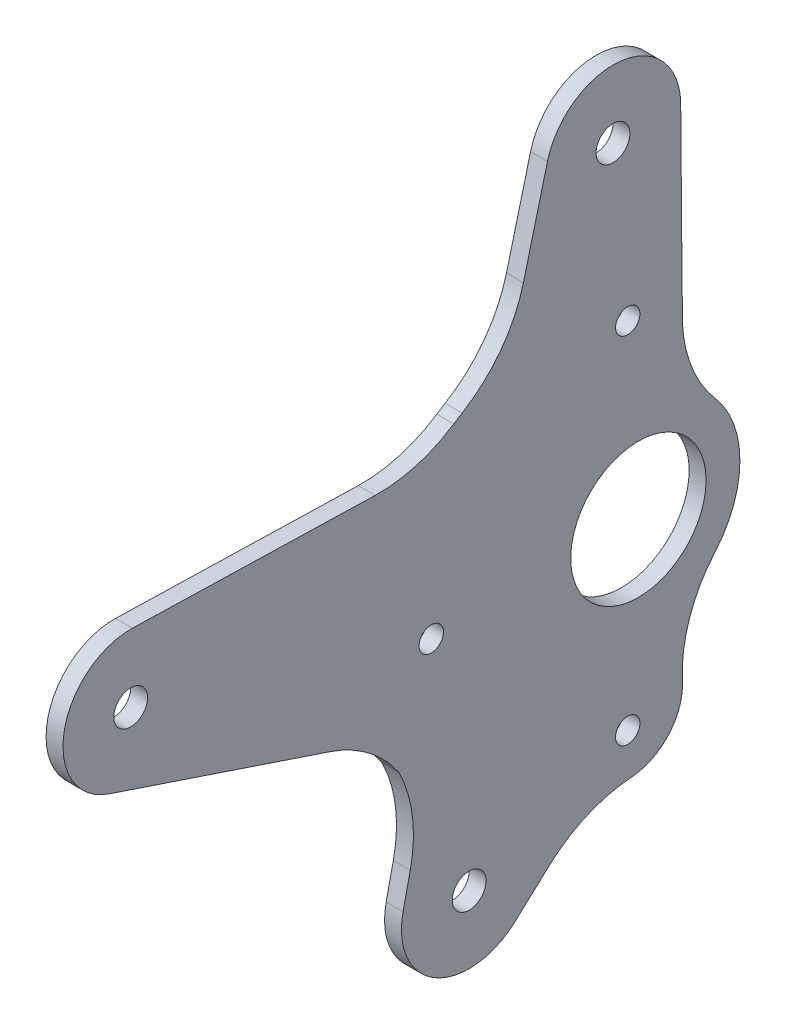
ISO-10303-21;
HEADER;
FILE_DESCRIPTION(('STEP AP214'),'2;1');
FILE_NAME('part.step','',(''),(''),'','','');
FILE_SCHEMA(('AUTOMOTIVE_DESIGN { 1 0 10303 214 1 1 1 1 }'));
ENDSEC;
DATA;
#1=APPLICATION_CONTEXT('core data for automotive mechanical design processes');
#2=APPLICATION_PROTOCOL_DEFINITION('international standard','automotive_design',2000,#1);
#3=PRODUCT_CONTEXT('',#1,'mechanical');
#4=PRODUCT('Part','Part','',(#3));
#5=PRODUCT_RELATED_PRODUCT_CATEGORY('part','',(#4));
#6=PRODUCT_DEFINITION_FORMATION('','',#4);
#7=PRODUCT_DEFINITION_CONTEXT('part definition',#1,'design');
#8=PRODUCT_DEFINITION('design','',#6,#7);
#9=PRODUCT_DEFINITION_SHAPE('','',#8);
#10=(LENGTH_UNIT() NAMED_UNIT(*) SI_UNIT(.MILLI.,.METRE.));
#11=(NAMED_UNIT(*) PLANE_ANGLE_UNIT() SI_UNIT($,.RADIAN.));
#12=(NAMED_UNIT(*) SI_UNIT($,.STERADIAN.) SOLID_ANGLE_UNIT());
#13=UNCERTAINTY_MEASURE_WITH_UNIT(LENGTH_MEASURE(1.E-05),#10,'distance_accuracy_value','');
#14=(GEOMETRIC_REPRESENTATION_CONTEXT(3) GLOBAL_UNCERTAINTY_ASSIGNED_CONTEXT((#13)) GLOBAL_UNIT_ASSIGNED_CONTEXT((#10,
#11,#12)) REPRESENTATION_CONTEXT('',''));
#15=CARTESIAN_POINT('',(0.,0.,0.));
#16=DIRECTION('',(0.,0.,1.));
#17=DIRECTION('',(1.,0.,0.));
#18=AXIS2_PLACEMENT_3D('',#15,#16,#17);
#19=CARTESIAN_POINT('',(-3.175,0.,0.));
#20=DIRECTION('',(1.,0.,0.));
#21=DIRECTION('',(0.,0.,-1.));
#22=AXIS2_PLACEMENT_3D('',#19,#20,#21);
#23=PLANE('',#22);
#24=CARTESIAN_POINT('',(-3.175,41.275,2.00000000000017));
#25=CARTESIAN_POINT('',(-3.175,41.275,72.6458636832659));
#26=CARTESIAN_POINT('',(-3.175,-41.275,61.4874696500673));
#27=CARTESIAN_POINT('',(-3.175,-41.275,2.00000000000017));
#28=B_SPLINE_CURVE_WITH_KNOTS('',3,(#24,#25,#26,#27),.UNSPECIFIED.,.F.,.F.,(4,4),(0.,1.),.UNSPECIFIED.);
#29=CARTESIAN_POINT('',(-3.175,33.8133672718998,33.0730524976087));
#30=VERTEX_POINT('',#29);
#31=CARTESIAN_POINT('',(-3.175,32.8160115880508,34.6500756912321));
#32=VERTEX_POINT('',#31);
#33=EDGE_CURVE('E489',#30,#32,#28,.T.);
#34=ORIENTED_EDGE('',*,*,#33,.F.);
#35=CARTESIAN_POINT('',(-3.175,55.5798412709307,46.1642942129508));
#36=DIRECTION('',(1.,0.,0.));
#37=DIRECTION('',(0.,0.,-1.));
#38=AXIS2_PLACEMENT_3D('',#35,#36,#37);
#39=CIRCLE('',#38,25.4);
#40=CARTESIAN_POINT('',(-3.175,49.2201891679587,21.5733441473441));
#41=VERTEX_POINT('',#40);
#42=EDGE_CURVE('E12',#30,#41,#39,.T.);
#43=ORIENTED_EDGE('',*,*,#42,.T.);
#44=DIRECTION('',(0.,-0.968147640378217,0.250380004054017));
#45=VECTOR('',#44,1.);
#46=CARTESIAN_POINT('',(-3.175,66.6798260514913,17.057975032802));
#47=LINE('',#46,#45);
#48=CARTESIAN_POINT('',(-3.175,66.6798260514913,17.057975032802));
#49=VERTEX_POINT('',#48);
#50=EDGE_CURVE('E410',#49,#41,#47,.T.);
#51=ORIENTED_EDGE('',*,*,#50,.F.);
#52=CARTESIAN_POINT('',(-3.175,63.5,4.76250000000001));
#53=DIRECTION('',(1.,0.,0.));
#54=DIRECTION('',(0.,0.,1.));
#55=AXIS2_PLACEMENT_3D('',#52,#53,#54);
#56=CIRCLE('',#55,12.7);
#57=CARTESIAN_POINT('',(-3.175,63.6108270008294,-7.93701642291497));
#58=VERTEX_POINT('',#57);
#59=EDGE_CURVE('E407',#58,#49,#56,.T.);
#60=ORIENTED_EDGE('',*,*,#59,.F.);
#61=DIRECTION('',(0.,0.999961923064171,0.00872653549838098));
#62=VECTOR('',#61,1.);
#63=CARTESIAN_POINT('',(-3.175,63.6108270008294,-7.93701642291497));
#64=LINE('',#63,#62);
#65=CARTESIAN_POINT('',(-3.175,33.047304679726,-8.20374024143136));
#66=VERTEX_POINT('',#65);
#67=EDGE_CURVE('E414',#66,#58,#64,.T.);
#68=ORIENTED_EDGE('',*,*,#67,.F.);
#69=CARTESIAN_POINT('',(-3.175,33.2689586813848,-33.6027730872613));
#70=DIRECTION('',(1.,0.,0.));
#71=DIRECTION('',(0.,0.,-1.));
#72=AXIS2_PLACEMENT_3D('',#69,#70,#71);
#73=CIRCLE('',#72,25.4);
#74=CARTESIAN_POINT('',(-3.175,31.6534982607126,-8.25419743439194));
#75=VERTEX_POINT('',#74);
#76=EDGE_CURVE('E590',#66,#75,#73,.T.);
#77=ORIENTED_EDGE('',*,*,#76,.T.);
#78=CARTESIAN_POINT('',(-3.175,30.9999999999871,2.00000000000016));
#79=DIRECTION('',(1.,0.,0.));
#80=DIRECTION('',(0.,0.,-1.));
#81=AXIS2_PLACEMENT_3D('',#78,#79,#80);
#82=CIRCLE('',#81,10.2750000000129);
#83=CARTESIAN_POINT('',(-3.175,30.4452831683227,-8.2600153136791));
#84=VERTEX_POINT('',#83);
#85=EDGE_CURVE('E451',#75,#84,#82,.F.);
#86=ORIENTED_EDGE('',*,*,#85,.T.);
#87=CARTESIAN_POINT('',(-3.175,29.074012363042,-33.6229728773897));
#88=DIRECTION('',(1.,0.,0.));
#89=DIRECTION('',(0.,0.,-1.));
#90=AXIS2_PLACEMENT_3D('',#87,#88,#89);
#91=CIRCLE('',#90,25.4);
#92=CARTESIAN_POINT('',(-3.175,12.4602910127323,-14.4098455188813));
#93=VERTEX_POINT('',#92);
#94=EDGE_CURVE('E457',#84,#93,#91,.T.);
#95=ORIENTED_EDGE('',*,*,#94,.T.);
#96=CARTESIAN_POINT('',(-3.175,0.,0.));
#97=DIRECTION('',(1.,0.,0.));
#98=DIRECTION('',(0.,0.,-1.));
#99=AXIS2_PLACEMENT_3D('',#96,#97,#98);
#100=CIRCLE('',#99,19.05);
#101=CARTESIAN_POINT('',(-3.175,-12.4602910127323,-14.4098455188813));
#102=VERTEX_POINT('',#101);
#103=EDGE_CURVE('E461',#93,#102,#100,.F.);
#104=ORIENTED_EDGE('',*,*,#103,.T.);
#105=CARTESIAN_POINT('',(-3.175,-29.074012363042,-33.6229728773897));
#106=DIRECTION('',(1.,0.,0.));
#107=DIRECTION('',(0.,0.,-1.));
#108=AXIS2_PLACEMENT_3D('',#105,#106,#107);
#109=CIRCLE('',#108,25.4);
#110=CARTESIAN_POINT('',(-3.175,-30.4452831683234,-8.26001531366554));
#111=VERTEX_POINT('',#110);
#112=EDGE_CURVE('E479',#111,#102,#109,.F.);
#113=ORIENTED_EDGE('',*,*,#112,.F.);
#114=CARTESIAN_POINT('',(-3.175,-31.0000000000129,2.00000000000017));
#115=DIRECTION('',(1.,0.,0.));
#116=DIRECTION('',(0.,0.,-1.));
#117=AXIS2_PLACEMENT_3D('',#114,#115,#116);
#118=CIRCLE('',#117,10.2750000000007);
#119=CARTESIAN_POINT('',(-3.175,-41.2500342971273,1.28416349073758));
#120=VERTEX_POINT('',#119);
#121=EDGE_CURVE('E481',#120,#111,#118,.T.);
#122=ORIENTED_EDGE('',*,*,#121,.F.);
#123=CARTESIAN_POINT('',(-3.175,-66.5883185936419,-0.485398293716785));
#124=DIRECTION('',(1.,0.,0.));
#125=DIRECTION('',(0.,0.,-1.));
#126=AXIS2_PLACEMENT_3D('',#123,#124,#125);
#127=CIRCLE('',#126,25.4);
#128=CARTESIAN_POINT('',(-3.175,-47.8614742386648,16.6745929797211));
#129=VERTEX_POINT('',#128);
#130=EDGE_CURVE('E578',#120,#129,#127,.T.);
#131=ORIENTED_EDGE('',*,*,#130,.T.);
#132=DIRECTION('',(0.,0.675590207615664,-0.73727733681012));
#133=VECTOR('',#132,1.);
#134=CARTESIAN_POINT('',(-3.175,-40.8727840179756,9.0477759305434));
#135=LINE('',#134,#133);
#136=CARTESIAN_POINT('',(-3.175,-53.8134221774885,23.1700043632811));
#137=VERTEX_POINT('',#136);
#138=EDGE_CURVE('E384',#137,#129,#135,.T.);
#139=ORIENTED_EDGE('',*,*,#138,.F.);
#140=CARTESIAN_POINT('',(-3.175,-44.45,31.75));
#141=DIRECTION('',(1.,0.,0.));
#142=DIRECTION('',(0.,0.,-1.));
#143=AXIS2_PLACEMENT_3D('',#140,#141,#142);
#144=CIRCLE('',#143,12.7);
#145=CARTESIAN_POINT('',(-3.175,-41.7012169029861,44.1489592904232));
#146=VERTEX_POINT('',#145);
#147=EDGE_CURVE('E374',#146,#137,#144,.T.);
#148=ORIENTED_EDGE('',*,*,#147,.F.);
#149=DIRECTION('',(0.,-0.976296007119933,0.216439613938104));
#150=VECTOR('',#149,1.);
#151=CARTESIAN_POINT('',(-3.175,-41.7012169029861,44.1489592904232));
#152=LINE('',#151,#150);
#153=CARTESIAN_POINT('',(-3.175,-35.6223929336524,42.8013164612759));
#154=VERTEX_POINT('',#153);
#155=EDGE_CURVE('E365',#154,#146,#152,.T.);
#156=ORIENTED_EDGE('',*,*,#155,.F.);
#157=CARTESIAN_POINT('',(-3.175,-30.1248267396245,67.5992350421222));
#158=DIRECTION('',(1.,0.,0.));
#159=DIRECTION('',(0.,0.,-1.));
#160=AXIS2_PLACEMENT_3D('',#157,#158,#159);
#161=CIRCLE('',#160,25.4);
#162=CARTESIAN_POINT('',(-3.175,-18.5802542848079,44.9744069359135));
#163=VERTEX_POINT('',#162);
#164=EDGE_CURVE('E238',#154,#163,#161,.T.);
#165=ORIENTED_EDGE('',*,*,#164,.T.);
#166=CARTESIAN_POINT('',(-3.175,-32.9048834464562,65.9497495882102));
#167=DIRECTION('',(1.,0.,0.));
#168=DIRECTION('',(0.,0.,-1.));
#169=AXIS2_PLACEMENT_3D('',#166,#167,#168);
#170=CIRCLE('',#169,25.4);
#171=CARTESIAN_POINT('',(-3.175,-8.81746260421729,57.8902113155251));
#172=VERTEX_POINT('',#171);
#173=EDGE_CURVE('E587',#163,#172,#170,.T.);
#174=ORIENTED_EDGE('',*,*,#173,.T.);
#175=DIRECTION('',(0.,-0.317304656404925,-0.948323655206255));
#176=VECTOR('',#175,1.);
#177=CARTESIAN_POINT('',(-3.175,5.03128971888127,99.2797691363447));
#178=LINE('',#177,#176);
#179=CARTESIAN_POINT('',(-3.175,5.03128971888127,99.2797691363447));
#180=VERTEX_POINT('',#179);
#181=EDGE_CURVE('E440',#180,#172,#178,.T.);
#182=ORIENTED_EDGE('',*,*,#181,.F.);
#183=CARTESIAN_POINT('',(-3.175,17.07500014,95.25));
#184=DIRECTION('',(1.,0.,0.));
#185=DIRECTION('',(0.,0.,-1.));
#186=AXIS2_PLACEMENT_3D('',#183,#184,#185);
#187=CIRCLE('',#186,12.7);
#188=CARTESIAN_POINT('',(-3.175,29.7706481671896,94.91755275649));
#189=VERTEX_POINT('',#188);
#190=EDGE_CURVE('E436',#189,#180,#187,.T.);
#191=ORIENTED_EDGE('',*,*,#190,.F.);
#192=DIRECTION('',(0.,0.0261769483078723,0.999657324975557));
#193=VECTOR('',#192,1.);
#194=CARTESIAN_POINT('',(-3.175,29.7706481671896,94.91755275649));
#195=LINE('',#194,#193);
#196=CARTESIAN_POINT('',(-3.175,28.5780842788664,49.3753752481572));
#197=VERTEX_POINT('',#196);
#198=EDGE_CURVE('E434',#197,#189,#195,.T.);
#199=ORIENTED_EDGE('',*,*,#198,.F.);
#200=CARTESIAN_POINT('',(-3.175,53.9693803332456,48.7104807611373));
#201=DIRECTION('',(1.,0.,0.));
#202=DIRECTION('',(0.,0.,-1.));
#203=AXIS2_PLACEMENT_3D('',#200,#201,#202);
#204=CIRCLE('',#203,25.4);
#205=EDGE_CURVE('E570',#197,#32,#204,.T.);
#206=ORIENTED_EDGE('',*,*,#205,.T.);
#207=EDGE_LOOP('',(#34,#43,#51,#60,#68,#77,#86,#95,#104,#113,#122,#131,#139,#148,#156,#165,#174,
#182,#191,#199,#206));
#208=FACE_BOUND('',#207,.T.);
#209=CARTESIAN_POINT('',(-3.175,-33.274,2.00000000000017));
#210=DIRECTION('',(1.,0.,0.));
#211=DIRECTION('',(0.,0.,-1.));
#212=AXIS2_PLACEMENT_3D('',#209,#210,#211);
#213=CIRCLE('',#212,2.286);
#214=CARTESIAN_POINT('',(-3.175,-33.274,-0.285999999999831));
#215=VERTEX_POINT('',#214);
#216=EDGE_CURVE('E631',#215,#215,#213,.T.);
#217=ORIENTED_EDGE('',*,*,#216,.T.);
#218=EDGE_LOOP('',(#217));
#219=FACE_BOUND('',#218,.T.);
#220=CARTESIAN_POINT('',(-3.175,0.,38.862));
#221=DIRECTION('',(1.,0.,0.));
#222=DIRECTION('',(0.,0.,-1.));
#223=AXIS2_PLACEMENT_3D('',#220,#221,#222);
#224=CIRCLE('',#223,2.286);
#225=CARTESIAN_POINT('',(-3.175,0.,36.576));
#226=VERTEX_POINT('',#225);
#227=EDGE_CURVE('E626',#226,#226,#224,.T.);
#228=ORIENTED_EDGE('',*,*,#227,.T.);
#229=EDGE_LOOP('',(#228));
#230=FACE_BOUND('',#229,.T.);
#231=CARTESIAN_POINT('',(-3.175,33.274,2.00000000000017));
#232=DIRECTION('',(1.,0.,0.));
#233=DIRECTION('',(0.,0.,-1.));
#234=AXIS2_PLACEMENT_3D('',#231,#232,#233);
#235=CIRCLE('',#234,2.286);
#236=CARTESIAN_POINT('',(-3.175,33.274,-0.285999999999831));
#237=VERTEX_POINT('',#236);
#238=EDGE_CURVE('E494',#237,#237,#235,.T.);
#239=ORIENTED_EDGE('',*,*,#238,.T.);
#240=EDGE_LOOP('',(#239));
#241=FACE_BOUND('',#240,.T.);
#242=CARTESIAN_POINT('',(-3.175,0.,0.));
#243=DIRECTION('',(1.,0.,0.));
#244=DIRECTION('',(0.,0.,-1.));
#245=AXIS2_PLACEMENT_3D('',#242,#243,#244);
#246=CIRCLE('',#245,12.7);
#247=CARTESIAN_POINT('',(-3.175,0.,-12.7));
#248=VERTEX_POINT('',#247);
#249=EDGE_CURVE('E615',#248,#248,#246,.T.);
#250=ORIENTED_EDGE('',*,*,#249,.T.);
#251=EDGE_LOOP('',(#250));
#252=FACE_BOUND('',#251,.T.);
#253=CARTESIAN_POINT('',(-3.175,17.07500014,95.25));
#254=DIRECTION('',(1.,0.,0.));
#255=DIRECTION('',(0.,0.,-1.));
#256=AXIS2_PLACEMENT_3D('',#253,#254,#255);
#257=CIRCLE('',#256,3.175);
#258=CARTESIAN_POINT('',(-3.175,17.07500014,92.075));
#259=VERTEX_POINT('',#258);
#260=EDGE_CURVE('E428',#259,#259,#257,.T.);
#261=ORIENTED_EDGE('',*,*,#260,.T.);
#262=EDGE_LOOP('',(#261));
#263=FACE_BOUND('',#262,.T.);
#264=CARTESIAN_POINT('',(-3.175,63.5,4.76250000000001));
#265=DIRECTION('',(1.,0.,0.));
#266=DIRECTION('',(0.,0.,-1.));
#267=AXIS2_PLACEMENT_3D('',#264,#265,#266);
#268=CIRCLE('',#267,3.17499999999999);
#269=CARTESIAN_POINT('',(-3.175,63.5,1.58750000000001));
#270=VERTEX_POINT('',#269);
#271=EDGE_CURVE('E401',#270,#270,#268,.T.);
#272=ORIENTED_EDGE('',*,*,#271,.T.);
#273=EDGE_LOOP('',(#272));
#274=FACE_BOUND('',#273,.T.);
#275=CARTESIAN_POINT('',(-3.175,-44.45,31.75));
#276=DIRECTION('',(1.,0.,0.));
#277=DIRECTION('',(0.,0.,-1.));
#278=AXIS2_PLACEMENT_3D('',#275,#276,#277);
#279=CIRCLE('',#278,3.175);
#280=CARTESIAN_POINT('',(-3.175,-44.45,28.575));
#281=VERTEX_POINT('',#280);
#282=EDGE_CURVE('E395',#281,#281,#279,.T.);
#283=ORIENTED_EDGE('',*,*,#282,.T.);
#284=EDGE_LOOP('',(#283));
#285=FACE_BOUND('',#284,.T.);
#286=ADVANCED_FACE('F222',(#208,#219,#230,#241,#252,#263,#274,#285),#23,.F.);
#287=CARTESIAN_POINT('',(0.,0.,0.));
#288=DIRECTION('',(1.,0.,0.));
#289=DIRECTION('',(0.,0.,-1.));
#290=AXIS2_PLACEMENT_3D('',#287,#288,#289);
#291=PLANE('',#290);
#292=DIRECTION('',(0.,-0.968147640378217,0.250380004054017));
#293=VECTOR('',#292,1.);
#294=CARTESIAN_POINT('',(0.,66.6798260514913,17.057975032802));
#295=LINE('',#294,#293);
#296=CARTESIAN_POINT('',(0.,66.6798260514913,17.057975032802));
#297=VERTEX_POINT('',#296);
#298=CARTESIAN_POINT('',(0.,49.2201891679587,21.5733441473441));
#299=VERTEX_POINT('',#298);
#300=EDGE_CURVE('E419',#297,#299,#295,.T.);
#301=ORIENTED_EDGE('',*,*,#300,.T.);
#302=CARTESIAN_POINT('',(0.,55.5798412709307,46.1642942129508));
#303=DIRECTION('',(1.,0.,0.));
#304=DIRECTION('',(0.,0.,-1.));
#305=AXIS2_PLACEMENT_3D('',#302,#303,#304);
#306=CIRCLE('',#305,25.4);
#307=CARTESIAN_POINT('',(0.,33.8133672718998,33.0730524976087));
#308=VERTEX_POINT('',#307);
#309=EDGE_CURVE('E231',#299,#308,#306,.F.);
#310=ORIENTED_EDGE('',*,*,#309,.T.);
#311=CARTESIAN_POINT('',(0.,41.275,2.00000000000017));
#312=CARTESIAN_POINT('',(0.,41.275,72.6458636832659));
#313=CARTESIAN_POINT('',(0.,-41.275,61.4874696500673));
#314=CARTESIAN_POINT('',(0.,-41.275,2.00000000000017));
#315=B_SPLINE_CURVE_WITH_KNOTS('',3,(#311,#312,#313,#314),.UNSPECIFIED.,.F.,.F.,(4,4),(0.,1.),.UNSPECIFIED.);
#316=CARTESIAN_POINT('',(0.,32.8160115880508,34.6500756912321));
#317=VERTEX_POINT('',#316);
#318=EDGE_CURVE('E474',#308,#317,#315,.T.);
#319=ORIENTED_EDGE('',*,*,#318,.T.);
#320=CARTESIAN_POINT('',(0.,53.9693803332456,48.7104807611373));
#321=DIRECTION('',(1.,0.,0.));
#322=DIRECTION('',(0.,0.,-1.));
#323=AXIS2_PLACEMENT_3D('',#320,#321,#322);
#324=CIRCLE('',#323,25.4);
#325=CARTESIAN_POINT('',(0.,28.5780842788664,49.3753752481572));
#326=VERTEX_POINT('',#325);
#327=EDGE_CURVE('E575',#317,#326,#324,.F.);
#328=ORIENTED_EDGE('',*,*,#327,.T.);
#329=DIRECTION('',(0.,0.0261769483078723,0.999657324975557));
#330=VECTOR('',#329,1.);
#331=CARTESIAN_POINT('',(0.,29.7706481671896,94.91755275649));
#332=LINE('',#331,#330);
#333=CARTESIAN_POINT('',(0.,29.7706481671896,94.91755275649));
#334=VERTEX_POINT('',#333);
#335=EDGE_CURVE('E431',#326,#334,#332,.T.);
#336=ORIENTED_EDGE('',*,*,#335,.T.);
#337=CARTESIAN_POINT('',(0.,17.07500014,95.25));
#338=DIRECTION('',(1.,0.,0.));
#339=DIRECTION('',(0.,0.,-1.));
#340=AXIS2_PLACEMENT_3D('',#337,#338,#339);
#341=CIRCLE('',#340,12.7);
#342=CARTESIAN_POINT('',(0.,5.03128971888127,99.2797691363447));
#343=VERTEX_POINT('',#342);
#344=EDGE_CURVE('E445',#334,#343,#341,.T.);
#345=ORIENTED_EDGE('',*,*,#344,.T.);
#346=DIRECTION('',(0.,-0.317304656404925,-0.948323655206255));
#347=VECTOR('',#346,1.);
#348=CARTESIAN_POINT('',(0.,5.03128971888127,99.2797691363447));
#349=LINE('',#348,#347);
#350=CARTESIAN_POINT('',(0.,-8.81746260421729,57.8902113155251));
#351=VERTEX_POINT('',#350);
#352=EDGE_CURVE('E437',#343,#351,#349,.T.);
#353=ORIENTED_EDGE('',*,*,#352,.T.);
#354=CARTESIAN_POINT('',(0.,-32.9048834464562,65.9497495882102));
#355=DIRECTION('',(1.,0.,0.));
#356=DIRECTION('',(0.,0.,-1.));
#357=AXIS2_PLACEMENT_3D('',#354,#355,#356);
#358=CIRCLE('',#357,25.4);
#359=CARTESIAN_POINT('',(0.,-18.5802542848079,44.9744069359135));
#360=VERTEX_POINT('',#359);
#361=EDGE_CURVE('E246',#351,#360,#358,.F.);
#362=ORIENTED_EDGE('',*,*,#361,.T.);
#363=CARTESIAN_POINT('',(0.,-30.1248267396245,67.5992350421222));
#364=DIRECTION('',(1.,0.,0.));
#365=DIRECTION('',(0.,0.,-1.));
#366=AXIS2_PLACEMENT_3D('',#363,#364,#365);
#367=CIRCLE('',#366,25.4);
#368=CARTESIAN_POINT('',(0.,-35.6223929336524,42.8013164612759));
#369=VERTEX_POINT('',#368);
#370=EDGE_CURVE('E585',#360,#369,#367,.F.);
#371=ORIENTED_EDGE('',*,*,#370,.T.);
#372=DIRECTION('',(0.,-0.976296007119933,0.216439613938104));
#373=VECTOR('',#372,1.);
#374=CARTESIAN_POINT('',(0.,-41.7012169029861,44.1489592904232));
#375=LINE('',#374,#373);
#376=CARTESIAN_POINT('',(0.,-41.7012169029861,44.1489592904232));
#377=VERTEX_POINT('',#376);
#378=EDGE_CURVE('E393',#369,#377,#375,.T.);
#379=ORIENTED_EDGE('',*,*,#378,.T.);
#380=CARTESIAN_POINT('',(0.,-44.45,31.75));
#381=DIRECTION('',(1.,0.,0.));
#382=DIRECTION('',(0.,0.,-1.));
#383=AXIS2_PLACEMENT_3D('',#380,#381,#382);
#384=CIRCLE('',#383,12.7);
#385=CARTESIAN_POINT('',(0.,-53.8134221774885,23.1700043632811));
#386=VERTEX_POINT('',#385);
#387=EDGE_CURVE('E382',#377,#386,#384,.T.);
#388=ORIENTED_EDGE('',*,*,#387,.T.);
#389=DIRECTION('',(0.,0.675590207615664,-0.73727733681012));
#390=VECTOR('',#389,1.);
#391=CARTESIAN_POINT('',(0.,-40.8727840179756,9.0477759305434));
#392=LINE('',#391,#390);
#393=CARTESIAN_POINT('',(0.,-47.8614742386648,16.6745929797211));
#394=VERTEX_POINT('',#393);
#395=EDGE_CURVE('E375',#386,#394,#392,.T.);
#396=ORIENTED_EDGE('',*,*,#395,.T.);
#397=CARTESIAN_POINT('',(0.,-66.5883185936419,-0.485398293716785));
#398=DIRECTION('',(1.,0.,0.));
#399=DIRECTION('',(0.,0.,-1.));
#400=AXIS2_PLACEMENT_3D('',#397,#398,#399);
#401=CIRCLE('',#400,25.4);
#402=CARTESIAN_POINT('',(0.,-41.2500342971273,1.28416349073758));
#403=VERTEX_POINT('',#402);
#404=EDGE_CURVE('E582',#394,#403,#401,.F.);
#405=ORIENTED_EDGE('',*,*,#404,.T.);
#406=CARTESIAN_POINT('',(0.,-31.0000000000129,2.00000000000017));
#407=DIRECTION('',(1.,0.,0.));
#408=DIRECTION('',(0.,0.,-1.));
#409=AXIS2_PLACEMENT_3D('',#406,#407,#408);
#410=CIRCLE('',#409,10.2750000000007);
#411=CARTESIAN_POINT('',(0.,-30.4452831683234,-8.26001531366554));
#412=VERTEX_POINT('',#411);
#413=EDGE_CURVE('E469',#403,#412,#410,.T.);
#414=ORIENTED_EDGE('',*,*,#413,.T.);
#415=CARTESIAN_POINT('',(0.,-29.074012363042,-33.6229728773897));
#416=DIRECTION('',(1.,0.,0.));
#417=DIRECTION('',(0.,0.,-1.));
#418=AXIS2_PLACEMENT_3D('',#415,#416,#417);
#419=CIRCLE('',#418,25.4);
#420=CARTESIAN_POINT('',(0.,-12.4602910127323,-14.4098455188813));
#421=VERTEX_POINT('',#420);
#422=EDGE_CURVE('E465',#412,#421,#419,.F.);
#423=ORIENTED_EDGE('',*,*,#422,.T.);
#424=CARTESIAN_POINT('',(0.,0.,0.));
#425=DIRECTION('',(1.,0.,0.));
#426=DIRECTION('',(0.,0.,-1.));
#427=AXIS2_PLACEMENT_3D('',#424,#425,#426);
#428=CIRCLE('',#427,19.05);
#429=CARTESIAN_POINT('',(0.,12.4602910127323,-14.4098455188813));
#430=VERTEX_POINT('',#429);
#431=EDGE_CURVE('E472',#430,#421,#428,.F.);
#432=ORIENTED_EDGE('',*,*,#431,.F.);
#433=CARTESIAN_POINT('',(0.,29.074012363042,-33.6229728773897));
#434=DIRECTION('',(1.,0.,0.));
#435=DIRECTION('',(0.,0.,-1.));
#436=AXIS2_PLACEMENT_3D('',#433,#434,#435);
#437=CIRCLE('',#436,25.4);
#438=CARTESIAN_POINT('',(0.,30.4452831683227,-8.2600153136791));
#439=VERTEX_POINT('',#438);
#440=EDGE_CURVE('E475',#439,#430,#437,.T.);
#441=ORIENTED_EDGE('',*,*,#440,.F.);
#442=CARTESIAN_POINT('',(0.,30.9999999999871,2.00000000000016));
#443=DIRECTION('',(1.,0.,0.));
#444=DIRECTION('',(0.,0.,-1.));
#445=AXIS2_PLACEMENT_3D('',#442,#443,#444);
#446=CIRCLE('',#445,10.2750000000129);
#447=CARTESIAN_POINT('',(0.,31.6534982607126,-8.25419743439194));
#448=VERTEX_POINT('',#447);
#449=EDGE_CURVE('E477',#448,#439,#446,.F.);
#450=ORIENTED_EDGE('',*,*,#449,.F.);
#451=CARTESIAN_POINT('',(0.,33.2689586813848,-33.6027730872613));
#452=DIRECTION('',(1.,0.,0.));
#453=DIRECTION('',(0.,0.,-1.));
#454=AXIS2_PLACEMENT_3D('',#451,#452,#453);
#455=CIRCLE('',#454,25.4);
#456=CARTESIAN_POINT('',(0.,33.047304679726,-8.20374024143136));
#457=VERTEX_POINT('',#456);
#458=EDGE_CURVE('E592',#448,#457,#455,.F.);
#459=ORIENTED_EDGE('',*,*,#458,.T.);
#460=DIRECTION('',(0.,0.999961923064171,0.00872653549838098));
#461=VECTOR('',#460,1.);
#462=CARTESIAN_POINT('',(0.,63.6108270008294,-7.93701642291497));
#463=LINE('',#462,#461);
#464=CARTESIAN_POINT('',(0.,63.6108270008294,-7.93701642291497));
#465=VERTEX_POINT('',#464);
#466=EDGE_CURVE('E411',#457,#465,#463,.T.);
#467=ORIENTED_EDGE('',*,*,#466,.T.);
#468=CARTESIAN_POINT('',(0.,63.5,4.76250000000001));
#469=DIRECTION('',(1.,0.,0.));
#470=DIRECTION('',(0.,0.,1.));
#471=AXIS2_PLACEMENT_3D('',#468,#469,#470);
#472=CIRCLE('',#471,12.7);
#473=EDGE_CURVE('E404',#465,#297,#472,.T.);
#474=ORIENTED_EDGE('',*,*,#473,.T.);
#475=EDGE_LOOP('',(#301,#310,#319,#328,#336,#345,#353,#362,#371,#379,#388,#396,#405,#414,#423,
#432,#441,#450,#459,#467,#474));
#476=FACE_BOUND('',#475,.T.);
#477=CARTESIAN_POINT('',(0.,-33.274,2.00000000000017));
#478=DIRECTION('',(1.,0.,0.));
#479=DIRECTION('',(0.,0.,-1.));
#480=AXIS2_PLACEMENT_3D('',#477,#478,#479);
#481=CIRCLE('',#480,2.286);
#482=CARTESIAN_POINT('',(0.,-33.274,-0.285999999999831));
#483=VERTEX_POINT('',#482);
#484=EDGE_CURVE('E509',#483,#483,#481,.T.);
#485=ORIENTED_EDGE('',*,*,#484,.F.);
#486=EDGE_LOOP('',(#485));
#487=FACE_BOUND('',#486,.T.);
#488=CARTESIAN_POINT('',(0.,0.,38.862));
#489=DIRECTION('',(1.,0.,0.));
#490=DIRECTION('',(0.,0.,-1.));
#491=AXIS2_PLACEMENT_3D('',#488,#489,#490);
#492=CIRCLE('',#491,2.286);
#493=CARTESIAN_POINT('',(0.,0.,36.576));
#494=VERTEX_POINT('',#493);
#495=EDGE_CURVE('E629',#494,#494,#492,.T.);
#496=ORIENTED_EDGE('',*,*,#495,.F.);
#497=EDGE_LOOP('',(#496));
#498=FACE_BOUND('',#497,.T.);
#499=CARTESIAN_POINT('',(0.,33.274,2.00000000000017));
#500=DIRECTION('',(1.,0.,0.));
#501=DIRECTION('',(0.,0.,-1.));
#502=AXIS2_PLACEMENT_3D('',#499,#500,#501);
#503=CIRCLE('',#502,2.286);
#504=CARTESIAN_POINT('',(0.,33.274,-0.285999999999831));
#505=VERTEX_POINT('',#504);
#506=EDGE_CURVE('E623',#505,#505,#503,.T.);
#507=ORIENTED_EDGE('',*,*,#506,.F.);
#508=EDGE_LOOP('',(#507));
#509=FACE_BOUND('',#508,.T.);
#510=CARTESIAN_POINT('',(0.,0.,0.));
#511=DIRECTION('',(1.,0.,0.));
#512=DIRECTION('',(0.,0.,-1.));
#513=AXIS2_PLACEMENT_3D('',#510,#511,#512);
#514=CIRCLE('',#513,12.7);
#515=CARTESIAN_POINT('',(0.,0.,-12.7));
#516=VERTEX_POINT('',#515);
#517=EDGE_CURVE('E616',#516,#516,#514,.T.);
#518=ORIENTED_EDGE('',*,*,#517,.F.);
#519=EDGE_LOOP('',(#518));
#520=FACE_BOUND('',#519,.T.);
#521=CARTESIAN_POINT('',(0.,17.07500014,95.25));
#522=DIRECTION('',(1.,0.,0.));
#523=DIRECTION('',(0.,0.,-1.));
#524=AXIS2_PLACEMENT_3D('',#521,#522,#523);
#525=CIRCLE('',#524,3.175);
#526=CARTESIAN_POINT('',(0.,17.07500014,92.075));
#527=VERTEX_POINT('',#526);
#528=EDGE_CURVE('E426',#527,#527,#525,.T.);
#529=ORIENTED_EDGE('',*,*,#528,.F.);
#530=EDGE_LOOP('',(#529));
#531=FACE_BOUND('',#530,.T.);
#532=CARTESIAN_POINT('',(0.,63.5,4.76250000000001));
#533=DIRECTION('',(1.,0.,0.));
#534=DIRECTION('',(0.,0.,-1.));
#535=AXIS2_PLACEMENT_3D('',#532,#533,#534);
#536=CIRCLE('',#535,3.17499999999999);
#537=CARTESIAN_POINT('',(0.,63.5,1.58750000000001));
#538=VERTEX_POINT('',#537);
#539=EDGE_CURVE('E399',#538,#538,#536,.T.);
#540=ORIENTED_EDGE('',*,*,#539,.F.);
#541=EDGE_LOOP('',(#540));
#542=FACE_BOUND('',#541,.T.);
#543=CARTESIAN_POINT('',(0.,-44.45,31.75));
#544=DIRECTION('',(1.,0.,0.));
#545=DIRECTION('',(0.,0.,-1.));
#546=AXIS2_PLACEMENT_3D('',#543,#544,#545);
#547=CIRCLE('',#546,3.175);
#548=CARTESIAN_POINT('',(0.,-44.45,28.575));
#549=VERTEX_POINT('',#548);
#550=EDGE_CURVE('E651',#549,#549,#547,.T.);
#551=ORIENTED_EDGE('',*,*,#550,.F.);
#552=EDGE_LOOP('',(#551));
#553=FACE_BOUND('',#552,.T.);
#554=ADVANCED_FACE('F538',(#476,#487,#498,#509,#520,#531,#542,#553),#291,.T.);
#555=CARTESIAN_POINT('',(-3.175,0.,0.));
#556=DIRECTION('',(1.,0.,0.));
#557=DIRECTION('',(0.,0.,-1.));
#558=AXIS2_PLACEMENT_3D('',#555,#556,#557);
#559=CYLINDRICAL_SURFACE('',#558,12.7);
#560=ORIENTED_EDGE('',*,*,#249,.F.);
#561=EDGE_LOOP('',(#560));
#562=FACE_BOUND('',#561,.T.);
#563=ORIENTED_EDGE('',*,*,#517,.T.);
#564=EDGE_LOOP('',(#563));
#565=FACE_BOUND('',#564,.T.);
#566=ADVANCED_FACE('F534',(#562,#565),#559,.F.);
#567=CARTESIAN_POINT('',(-3.175,33.274,2.00000000000017));
#568=DIRECTION('',(1.,0.,0.));
#569=DIRECTION('',(0.,0.,-1.));
#570=AXIS2_PLACEMENT_3D('',#567,#568,#569);
#571=CYLINDRICAL_SURFACE('',#570,2.286);
#572=ORIENTED_EDGE('',*,*,#506,.T.);
#573=EDGE_LOOP('',(#572));
#574=FACE_BOUND('',#573,.T.);
#575=ORIENTED_EDGE('',*,*,#238,.F.);
#576=EDGE_LOOP('',(#575));
#577=FACE_BOUND('',#576,.T.);
#578=ADVANCED_FACE('F530',(#574,#577),#571,.F.);
#579=CARTESIAN_POINT('',(-3.175,0.,38.862));
#580=DIRECTION('',(1.,0.,0.));
#581=DIRECTION('',(0.,0.,-1.));
#582=AXIS2_PLACEMENT_3D('',#579,#580,#581);
#583=CYLINDRICAL_SURFACE('',#582,2.286);
#584=ORIENTED_EDGE('',*,*,#495,.T.);
#585=EDGE_LOOP('',(#584));
#586=FACE_BOUND('',#585,.T.);
#587=ORIENTED_EDGE('',*,*,#227,.F.);
#588=EDGE_LOOP('',(#587));
#589=FACE_BOUND('',#588,.T.);
#590=ADVANCED_FACE('F526',(#586,#589),#583,.F.);
#591=CARTESIAN_POINT('',(-3.175,-33.274,2.00000000000017));
#592=DIRECTION('',(1.,0.,0.));
#593=DIRECTION('',(0.,0.,-1.));
#594=AXIS2_PLACEMENT_3D('',#591,#592,#593);
#595=CYLINDRICAL_SURFACE('',#594,2.286);
#596=ORIENTED_EDGE('',*,*,#484,.T.);
#597=EDGE_LOOP('',(#596));
#598=FACE_BOUND('',#597,.T.);
#599=ORIENTED_EDGE('',*,*,#216,.F.);
#600=EDGE_LOOP('',(#599));
#601=FACE_BOUND('',#600,.T.);
#602=ADVANCED_FACE('F520',(#598,#601),#595,.F.);
#603=CARTESIAN_POINT('',(0.,41.275,2.00000000000017));
#604=CARTESIAN_POINT('',(0.,41.275,72.6458636832659));
#605=CARTESIAN_POINT('',(0.,-41.275,61.4874696500673));
#606=CARTESIAN_POINT('',(0.,-41.275,2.00000000000017));
#607=B_SPLINE_CURVE_WITH_KNOTS('',3,(#603,#604,#605,#606),.UNSPECIFIED.,.F.,.F.,(4,4),(0.,1.),.UNSPECIFIED.);
#608=DIRECTION('',(1.,0.,0.));
#609=VECTOR('',#608,1.);
#610=SURFACE_OF_LINEAR_EXTRUSION('',#607,#609);
#611=ORIENTED_EDGE('',*,*,#33,.T.);
#612=DIRECTION('',(1.,0.,0.));
#613=VECTOR('',#612,1.);
#614=CARTESIAN_POINT('',(-3.175,32.8160115880423,34.6500756912448));
#615=LINE('',#614,#613);
#616=EDGE_CURVE('E573',#32,#317,#615,.T.);
#617=ORIENTED_EDGE('',*,*,#616,.T.);
#618=ORIENTED_EDGE('',*,*,#318,.F.);
#619=DIRECTION('',(1.,0.,0.));
#620=VECTOR('',#619,1.);
#621=CARTESIAN_POINT('',(0.,33.8133672718991,33.07305249761));
#622=LINE('',#621,#620);
#623=EDGE_CURVE('E599',#308,#30,#622,.F.);
#624=ORIENTED_EDGE('',*,*,#623,.T.);
#625=EDGE_LOOP('',(#611,#617,#618,#624));
#626=FACE_BOUND('',#625,.T.);
#627=ADVANCED_FACE('F515',(#626),#610,.T.);
#628=CARTESIAN_POINT('',(0.,30.9999999999871,2.00000000000016));
#629=DIRECTION('',(1.,0.,0.));
#630=DIRECTION('',(0.,0.,-1.));
#631=AXIS2_PLACEMENT_3D('',#628,#629,#630);
#632=CYLINDRICAL_SURFACE('',#631,10.2750000000129);
#633=ORIENTED_EDGE('',*,*,#85,.F.);
#634=DIRECTION('',(1.,0.,0.));
#635=VECTOR('',#634,1.);
#636=CARTESIAN_POINT('',(0.,31.6534982607126,-8.25419743439194));
#637=LINE('',#636,#635);
#638=EDGE_CURVE('E612',#75,#448,#637,.T.);
#639=ORIENTED_EDGE('',*,*,#638,.T.);
#640=ORIENTED_EDGE('',*,*,#449,.T.);
#641=DIRECTION('',(1.,0.,0.));
#642=VECTOR('',#641,1.);
#643=CARTESIAN_POINT('',(0.,30.4452831683227,-8.2600153136791));
#644=LINE('',#643,#642);
#645=EDGE_CURVE('E454',#439,#84,#644,.F.);
#646=ORIENTED_EDGE('',*,*,#645,.T.);
#647=EDGE_LOOP('',(#633,#639,#640,#646));
#648=FACE_BOUND('',#647,.T.);
#649=ADVANCED_FACE('F519',(#648),#632,.T.);
#650=CARTESIAN_POINT('',(0.,29.074012363042,-33.6229728773897));
#651=DIRECTION('',(1.,0.,0.));
#652=DIRECTION('',(0.,0.,-1.));
#653=AXIS2_PLACEMENT_3D('',#650,#651,#652);
#654=CYLINDRICAL_SURFACE('',#653,25.4);
#655=ORIENTED_EDGE('',*,*,#645,.F.);
#656=ORIENTED_EDGE('',*,*,#440,.T.);
#657=DIRECTION('',(1.,0.,0.));
#658=VECTOR('',#657,1.);
#659=CARTESIAN_POINT('',(0.,12.4602910127323,-14.4098455188813));
#660=LINE('',#659,#658);
#661=EDGE_CURVE('E458',#430,#93,#660,.F.);
#662=ORIENTED_EDGE('',*,*,#661,.T.);
#663=ORIENTED_EDGE('',*,*,#94,.F.);
#664=EDGE_LOOP('',(#655,#656,#662,#663));
#665=FACE_BOUND('',#664,.T.);
#666=ADVANCED_FACE('F680',(#665),#654,.F.);
#667=CARTESIAN_POINT('',(0.,0.,0.));
#668=DIRECTION('',(1.,0.,0.));
#669=DIRECTION('',(0.,0.,-1.));
#670=AXIS2_PLACEMENT_3D('',#667,#668,#669);
#671=CYLINDRICAL_SURFACE('',#670,19.05);
#672=ORIENTED_EDGE('',*,*,#661,.F.);
#673=ORIENTED_EDGE('',*,*,#431,.T.);
#674=DIRECTION('',(1.,0.,0.));
#675=VECTOR('',#674,1.);
#676=CARTESIAN_POINT('',(0.,-12.4602910127323,-14.4098455188813));
#677=LINE('',#676,#675);
#678=EDGE_CURVE('E462',#421,#102,#677,.F.);
#679=ORIENTED_EDGE('',*,*,#678,.T.);
#680=ORIENTED_EDGE('',*,*,#103,.F.);
#681=EDGE_LOOP('',(#672,#673,#679,#680));
#682=FACE_BOUND('',#681,.T.);
#683=ADVANCED_FACE('F676',(#682),#671,.T.);
#684=CARTESIAN_POINT('',(0.,-29.074012363042,-33.6229728773897));
#685=DIRECTION('',(1.,0.,0.));
#686=DIRECTION('',(0.,0.,-1.));
#687=AXIS2_PLACEMENT_3D('',#684,#685,#686);
#688=CYLINDRICAL_SURFACE('',#687,25.4);
#689=ORIENTED_EDGE('',*,*,#678,.F.);
#690=ORIENTED_EDGE('',*,*,#422,.F.);
#691=DIRECTION('',(1.,0.,0.));
#692=VECTOR('',#691,1.);
#693=CARTESIAN_POINT('',(0.,-30.4452831683234,-8.26001531366554));
#694=LINE('',#693,#692);
#695=EDGE_CURVE('E466',#412,#111,#694,.F.);
#696=ORIENTED_EDGE('',*,*,#695,.T.);
#697=ORIENTED_EDGE('',*,*,#112,.T.);
#698=EDGE_LOOP('',(#689,#690,#696,#697));
#699=FACE_BOUND('',#698,.T.);
#700=ADVANCED_FACE('F672',(#699),#688,.F.);
#701=CARTESIAN_POINT('',(0.,-31.0000000000129,2.00000000000017));
#702=DIRECTION('',(1.,0.,0.));
#703=DIRECTION('',(0.,0.,-1.));
#704=AXIS2_PLACEMENT_3D('',#701,#702,#703);
#705=CYLINDRICAL_SURFACE('',#704,10.2750000000007);
#706=ORIENTED_EDGE('',*,*,#413,.F.);
#707=DIRECTION('',(1.,0.,0.));
#708=VECTOR('',#707,1.);
#709=CARTESIAN_POINT('',(0.,-41.2500342971273,1.28416349073758));
#710=LINE('',#709,#708);
#711=EDGE_CURVE('E601',#403,#120,#710,.F.);
#712=ORIENTED_EDGE('',*,*,#711,.T.);
#713=ORIENTED_EDGE('',*,*,#121,.T.);
#714=ORIENTED_EDGE('',*,*,#695,.F.);
#715=EDGE_LOOP('',(#706,#712,#713,#714));
#716=FACE_BOUND('',#715,.T.);
#717=ADVANCED_FACE('F522',(#716),#705,.T.);
#718=CARTESIAN_POINT('',(-3.175,5.03128971888127,99.2797691363447));
#719=DIRECTION('',(0.,-0.948323655206255,0.317304656404925));
#720=DIRECTION('',(0.,-0.317304656404925,-0.948323655206255));
#721=AXIS2_PLACEMENT_3D('',#718,#719,#720);
#722=PLANE('',#721);
#723=ORIENTED_EDGE('',*,*,#181,.T.);
#724=DIRECTION('',(-1.,0.,0.));
#725=VECTOR('',#724,1.);
#726=CARTESIAN_POINT('',(0.,-8.81746260421729,57.8902113155251));
#727=LINE('',#726,#725);
#728=EDGE_CURVE('E607',#172,#351,#727,.F.);
#729=ORIENTED_EDGE('',*,*,#728,.T.);
#730=ORIENTED_EDGE('',*,*,#352,.F.);
#731=DIRECTION('',(1.,0.,0.));
#732=VECTOR('',#731,1.);
#733=CARTESIAN_POINT('',(-3.175,5.03128971888127,99.2797691363447));
#734=LINE('',#733,#732);
#735=EDGE_CURVE('E449',#180,#343,#734,.T.);
#736=ORIENTED_EDGE('',*,*,#735,.F.);
#737=EDGE_LOOP('',(#723,#729,#730,#736));
#738=FACE_BOUND('',#737,.T.);
#739=ADVANCED_FACE('F715',(#738),#722,.T.);
#740=CARTESIAN_POINT('',(-3.175,17.07500014,95.25));
#741=DIRECTION('',(1.,0.,0.));
#742=DIRECTION('',(0.,0.,-1.));
#743=AXIS2_PLACEMENT_3D('',#740,#741,#742);
#744=CYLINDRICAL_SURFACE('',#743,12.7);
#745=ORIENTED_EDGE('',*,*,#344,.F.);
#746=DIRECTION('',(1.,0.,0.));
#747=VECTOR('',#746,1.);
#748=CARTESIAN_POINT('',(-3.175,29.7706481671896,94.91755275649));
#749=LINE('',#748,#747);
#750=EDGE_CURVE('E443',#189,#334,#749,.T.);
#751=ORIENTED_EDGE('',*,*,#750,.F.);
#752=ORIENTED_EDGE('',*,*,#190,.T.);
#753=ORIENTED_EDGE('',*,*,#735,.T.);
#754=EDGE_LOOP('',(#745,#751,#752,#753));
#755=FACE_BOUND('',#754,.T.);
#756=ADVANCED_FACE('F712',(#755),#744,.T.);
#757=CARTESIAN_POINT('',(-3.175,29.7706481671896,94.91755275649));
#758=DIRECTION('',(0.,0.999657324975557,-0.0261769483078723));
#759=DIRECTION('',(0.,0.0261769483078723,0.999657324975557));
#760=AXIS2_PLACEMENT_3D('',#757,#758,#759);
#761=PLANE('',#760);
#762=ORIENTED_EDGE('',*,*,#335,.F.);
#763=DIRECTION('',(-1.,0.,0.));
#764=VECTOR('',#763,1.);
#765=CARTESIAN_POINT('',(-3.175,28.5780842788664,49.3753752481572));
#766=LINE('',#765,#764);
#767=EDGE_CURVE('E571',#326,#197,#766,.T.);
#768=ORIENTED_EDGE('',*,*,#767,.T.);
#769=ORIENTED_EDGE('',*,*,#198,.T.);
#770=ORIENTED_EDGE('',*,*,#750,.T.);
#771=EDGE_LOOP('',(#762,#768,#769,#770));
#772=FACE_BOUND('',#771,.T.);
#773=ADVANCED_FACE('F707',(#772),#761,.T.);
#774=CARTESIAN_POINT('',(-3.175,17.07500014,95.25));
#775=DIRECTION('',(1.,0.,0.));
#776=DIRECTION('',(0.,0.,-1.));
#777=AXIS2_PLACEMENT_3D('',#774,#775,#776);
#778=CYLINDRICAL_SURFACE('',#777,3.175);
#779=ORIENTED_EDGE('',*,*,#260,.F.);
#780=EDGE_LOOP('',(#779));
#781=FACE_BOUND('',#780,.T.);
#782=ORIENTED_EDGE('',*,*,#528,.T.);
#783=EDGE_LOOP('',(#782));
#784=FACE_BOUND('',#783,.T.);
#785=ADVANCED_FACE('F725',(#781,#784),#778,.F.);
#786=CARTESIAN_POINT('',(-3.175,63.5,4.76250000000001));
#787=DIRECTION('',(1.,0.,0.));
#788=DIRECTION('',(0.,0.,-1.));
#789=AXIS2_PLACEMENT_3D('',#786,#787,#788);
#790=CYLINDRICAL_SURFACE('',#789,12.7);
#791=ORIENTED_EDGE('',*,*,#473,.F.);
#792=DIRECTION('',(1.,0.,0.));
#793=VECTOR('',#792,1.);
#794=CARTESIAN_POINT('',(-3.175,63.6108270008294,-7.93701642291497));
#795=LINE('',#794,#793);
#796=EDGE_CURVE('E423',#58,#465,#795,.T.);
#797=ORIENTED_EDGE('',*,*,#796,.F.);
#798=ORIENTED_EDGE('',*,*,#59,.T.);
#799=DIRECTION('',(1.,0.,0.));
#800=VECTOR('',#799,1.);
#801=CARTESIAN_POINT('',(-3.175,66.6798260514913,17.057975032802));
#802=LINE('',#801,#800);
#803=EDGE_CURVE('E416',#49,#297,#802,.T.);
#804=ORIENTED_EDGE('',*,*,#803,.T.);
#805=EDGE_LOOP('',(#791,#797,#798,#804));
#806=FACE_BOUND('',#805,.T.);
#807=ADVANCED_FACE('F697',(#806),#790,.T.);
#808=CARTESIAN_POINT('',(-3.175,63.6108270008294,-7.93701642291497));
#809=DIRECTION('',(0.,0.00872653549838098,-0.999961923064171));
#810=DIRECTION('',(0.,0.999961923064171,0.00872653549838098));
#811=AXIS2_PLACEMENT_3D('',#808,#809,#810);
#812=PLANE('',#811);
#813=ORIENTED_EDGE('',*,*,#466,.F.);
#814=DIRECTION('',(-1.,0.,0.));
#815=VECTOR('',#814,1.);
#816=CARTESIAN_POINT('',(-3.175,33.047304679726,-8.20374024143136));
#817=LINE('',#816,#815);
#818=EDGE_CURVE('E610',#457,#66,#817,.T.);
#819=ORIENTED_EDGE('',*,*,#818,.T.);
#820=ORIENTED_EDGE('',*,*,#67,.T.);
#821=ORIENTED_EDGE('',*,*,#796,.T.);
#822=EDGE_LOOP('',(#813,#819,#820,#821));
#823=FACE_BOUND('',#822,.T.);
#824=ADVANCED_FACE('F691',(#823),#812,.T.);
#825=CARTESIAN_POINT('',(-3.175,66.6798260514913,17.057975032802));
#826=DIRECTION('',(0.,0.250380004054017,0.968147640378218));
#827=DIRECTION('',(0.,-0.968147640378218,0.250380004054017));
#828=AXIS2_PLACEMENT_3D('',#825,#826,#827);
#829=PLANE('',#828);
#830=ORIENTED_EDGE('',*,*,#50,.T.);
#831=DIRECTION('',(-1.,0.,0.));
#832=VECTOR('',#831,1.);
#833=CARTESIAN_POINT('',(0.,49.2201891679587,21.5733441473441));
#834=LINE('',#833,#832);
#835=EDGE_CURVE('E594',#41,#299,#834,.F.);
#836=ORIENTED_EDGE('',*,*,#835,.T.);
#837=ORIENTED_EDGE('',*,*,#300,.F.);
#838=ORIENTED_EDGE('',*,*,#803,.F.);
#839=EDGE_LOOP('',(#830,#836,#837,#838));
#840=FACE_BOUND('',#839,.T.);
#841=ADVANCED_FACE('F701',(#840),#829,.T.);
#842=CARTESIAN_POINT('',(-3.175,63.5,4.76250000000001));
#843=DIRECTION('',(1.,0.,0.));
#844=DIRECTION('',(0.,0.,-1.));
#845=AXIS2_PLACEMENT_3D('',#842,#843,#844);
#846=CYLINDRICAL_SURFACE('',#845,3.17499999999999);
#847=ORIENTED_EDGE('',*,*,#271,.F.);
#848=EDGE_LOOP('',(#847));
#849=FACE_BOUND('',#848,.T.);
#850=ORIENTED_EDGE('',*,*,#539,.T.);
#851=EDGE_LOOP('',(#850));
#852=FACE_BOUND('',#851,.T.);
#853=ADVANCED_FACE('F787',(#849,#852),#846,.F.);
#854=CARTESIAN_POINT('',(-3.175,-40.8727840179756,9.0477759305434));
#855=DIRECTION('',(0.,-0.73727733681012,-0.675590207615664));
#856=DIRECTION('',(0.,0.675590207615665,-0.73727733681012));
#857=AXIS2_PLACEMENT_3D('',#854,#855,#856);
#858=PLANE('',#857);
#859=ORIENTED_EDGE('',*,*,#138,.T.);
#860=DIRECTION('',(-1.,0.,0.));
#861=VECTOR('',#860,1.);
#862=CARTESIAN_POINT('',(0.,-47.8614742386648,16.6745929797211));
#863=LINE('',#862,#861);
#864=EDGE_CURVE('E603',#129,#394,#863,.F.);
#865=ORIENTED_EDGE('',*,*,#864,.T.);
#866=ORIENTED_EDGE('',*,*,#395,.F.);
#867=DIRECTION('',(1.,0.,0.));
#868=VECTOR('',#867,1.);
#869=CARTESIAN_POINT('',(-3.175,-53.8134221774885,23.1700043632811));
#870=LINE('',#869,#868);
#871=EDGE_CURVE('E383',#137,#386,#870,.T.);
#872=ORIENTED_EDGE('',*,*,#871,.F.);
#873=EDGE_LOOP('',(#859,#865,#866,#872));
#874=FACE_BOUND('',#873,.T.);
#875=ADVANCED_FACE('F660',(#874),#858,.T.);
#876=CARTESIAN_POINT('',(-3.175,-44.45,31.75));
#877=DIRECTION('',(1.,0.,0.));
#878=DIRECTION('',(0.,0.,-1.));
#879=AXIS2_PLACEMENT_3D('',#876,#877,#878);
#880=CYLINDRICAL_SURFACE('',#879,12.7);
#881=ORIENTED_EDGE('',*,*,#387,.F.);
#882=DIRECTION('',(1.,0.,0.));
#883=VECTOR('',#882,1.);
#884=CARTESIAN_POINT('',(-3.175,-41.7012169029861,44.1489592904232));
#885=LINE('',#884,#883);
#886=EDGE_CURVE('E369',#146,#377,#885,.T.);
#887=ORIENTED_EDGE('',*,*,#886,.F.);
#888=ORIENTED_EDGE('',*,*,#147,.T.);
#889=ORIENTED_EDGE('',*,*,#871,.T.);
#890=EDGE_LOOP('',(#881,#887,#888,#889));
#891=FACE_BOUND('',#890,.T.);
#892=ADVANCED_FACE('F379',(#891),#880,.T.);
#893=CARTESIAN_POINT('',(-3.175,-41.7012169029861,44.1489592904232));
#894=DIRECTION('',(0.,0.216439613938104,0.976296007119933));
#895=DIRECTION('',(0.,-0.976296007119933,0.216439613938104));
#896=AXIS2_PLACEMENT_3D('',#893,#894,#895);
#897=PLANE('',#896);
#898=ORIENTED_EDGE('',*,*,#378,.F.);
#899=DIRECTION('',(-1.,0.,0.));
#900=VECTOR('',#899,1.);
#901=CARTESIAN_POINT('',(-3.175,-35.6223929336524,42.8013164612759));
#902=LINE('',#901,#900);
#903=EDGE_CURVE('E372',#369,#154,#902,.T.);
#904=ORIENTED_EDGE('',*,*,#903,.T.);
#905=ORIENTED_EDGE('',*,*,#155,.T.);
#906=ORIENTED_EDGE('',*,*,#886,.T.);
#907=EDGE_LOOP('',(#898,#904,#905,#906));
#908=FACE_BOUND('',#907,.T.);
#909=ADVANCED_FACE('F368',(#908),#897,.T.);
#910=CARTESIAN_POINT('',(-3.175,-44.45,31.75));
#911=DIRECTION('',(1.,0.,0.));
#912=DIRECTION('',(0.,0.,-1.));
#913=AXIS2_PLACEMENT_3D('',#910,#911,#912);
#914=CYLINDRICAL_SURFACE('',#913,3.175);
#915=ORIENTED_EDGE('',*,*,#282,.F.);
#916=EDGE_LOOP('',(#915));
#917=FACE_BOUND('',#916,.T.);
#918=ORIENTED_EDGE('',*,*,#550,.T.);
#919=EDGE_LOOP('',(#918));
#920=FACE_BOUND('',#919,.T.);
#921=ADVANCED_FACE('F548',(#917,#920),#914,.F.);
#922=CARTESIAN_POINT('',(0.,33.2689586813848,-33.6027730872613));
#923=DIRECTION('',(1.,0.,0.));
#924=DIRECTION('',(0.,0.,-1.));
#925=AXIS2_PLACEMENT_3D('',#922,#923,#924);
#926=CYLINDRICAL_SURFACE('',#925,25.4);
#927=ORIENTED_EDGE('',*,*,#76,.F.);
#928=ORIENTED_EDGE('',*,*,#818,.F.);
#929=ORIENTED_EDGE('',*,*,#458,.F.);
#930=ORIENTED_EDGE('',*,*,#638,.F.);
#931=EDGE_LOOP('',(#927,#928,#929,#930));
#932=FACE_BOUND('',#931,.T.);
#933=ADVANCED_FACE('F544',(#932),#926,.F.);
#934=CARTESIAN_POINT('',(-1.5875,-30.1248267396245,67.5992350421222));
#935=DIRECTION('',(1.,0.,0.));
#936=DIRECTION('',(0.,0.,-1.));
#937=AXIS2_PLACEMENT_3D('',#934,#935,#936);
#938=CYLINDRICAL_SURFACE('',#937,25.4);
#939=DIRECTION('',(1.,0.,0.));
#940=VECTOR('',#939,1.);
#941=CARTESIAN_POINT('',(-1.5875,-18.5802542848079,44.9744069359135));
#942=LINE('',#941,#940);
#943=EDGE_CURVE('E226',#163,#360,#942,.T.);
#944=ORIENTED_EDGE('',*,*,#943,.F.);
#945=ORIENTED_EDGE('',*,*,#164,.F.);
#946=ORIENTED_EDGE('',*,*,#903,.F.);
#947=ORIENTED_EDGE('',*,*,#370,.F.);
#948=EDGE_LOOP('',(#944,#945,#946,#947));
#949=FACE_BOUND('',#948,.T.);
#950=ADVANCED_FACE('F547',(#949),#938,.F.);
#951=CARTESIAN_POINT('',(-1.5875,-32.9048834464562,65.9497495882102));
#952=DIRECTION('',(1.,0.,0.));
#953=DIRECTION('',(0.,0.,-1.));
#954=AXIS2_PLACEMENT_3D('',#951,#952,#953);
#955=CYLINDRICAL_SURFACE('',#954,25.4);
#956=ORIENTED_EDGE('',*,*,#173,.F.);
#957=ORIENTED_EDGE('',*,*,#943,.T.);
#958=ORIENTED_EDGE('',*,*,#361,.F.);
#959=ORIENTED_EDGE('',*,*,#728,.F.);
#960=EDGE_LOOP('',(#956,#957,#958,#959));
#961=FACE_BOUND('',#960,.T.);
#962=ADVANCED_FACE('F550',(#961),#955,.F.);
#963=CARTESIAN_POINT('',(0.,-66.5883185936419,-0.485398293716785));
#964=DIRECTION('',(1.,0.,0.));
#965=DIRECTION('',(0.,0.,-1.));
#966=AXIS2_PLACEMENT_3D('',#963,#964,#965);
#967=CYLINDRICAL_SURFACE('',#966,25.4);
#968=ORIENTED_EDGE('',*,*,#130,.F.);
#969=ORIENTED_EDGE('',*,*,#711,.F.);
#970=ORIENTED_EDGE('',*,*,#404,.F.);
#971=ORIENTED_EDGE('',*,*,#864,.F.);
#972=EDGE_LOOP('',(#968,#969,#970,#971));
#973=FACE_BOUND('',#972,.T.);
#974=ADVANCED_FACE('F553',(#973),#967,.F.);
#975=CARTESIAN_POINT('',(-1.5875,53.9693803332456,48.7104807611373));
#976=DIRECTION('',(1.,0.,0.));
#977=DIRECTION('',(0.,0.,-1.));
#978=AXIS2_PLACEMENT_3D('',#975,#976,#977);
#979=CYLINDRICAL_SURFACE('',#978,25.4);
#980=ORIENTED_EDGE('',*,*,#205,.F.);
#981=ORIENTED_EDGE('',*,*,#767,.F.);
#982=ORIENTED_EDGE('',*,*,#327,.F.);
#983=ORIENTED_EDGE('',*,*,#616,.F.);
#984=EDGE_LOOP('',(#980,#981,#982,#983));
#985=FACE_BOUND('',#984,.T.);
#986=ADVANCED_FACE('F559',(#985),#979,.F.);
#987=CARTESIAN_POINT('',(-1.5875,55.5798412709307,46.1642942129508));
#988=DIRECTION('',(1.,0.,0.));
#989=DIRECTION('',(0.,0.,-1.));
#990=AXIS2_PLACEMENT_3D('',#987,#988,#989);
#991=CYLINDRICAL_SURFACE('',#990,25.4);
#992=ORIENTED_EDGE('',*,*,#42,.F.);
#993=ORIENTED_EDGE('',*,*,#623,.F.);
#994=ORIENTED_EDGE('',*,*,#309,.F.);
#995=ORIENTED_EDGE('',*,*,#835,.F.);
#996=EDGE_LOOP('',(#992,#993,#994,#995));
#997=FACE_BOUND('',#996,.T.);
#998=ADVANCED_FACE('F224',(#997),#991,.F.);
#999=CLOSED_SHELL('',(#286,#554,#566,#578,#590,#602,#627,#649,#666,#683,#700,#717,#739,#756,
#773,#785,#807,#824,#841,#853,#875,#892,#909,#921,#933,#950,#962,#974,#986,#998));
#1000=MANIFOLD_SOLID_BREP('B2',#999);
#1001=ADVANCED_BREP_SHAPE_REPRESENTATION('',(#18,#1000),#14);
#1002=SHAPE_DEFINITION_REPRESENTATION(#9,#1001);
ENDSEC;
END-ISO-10303-21;
